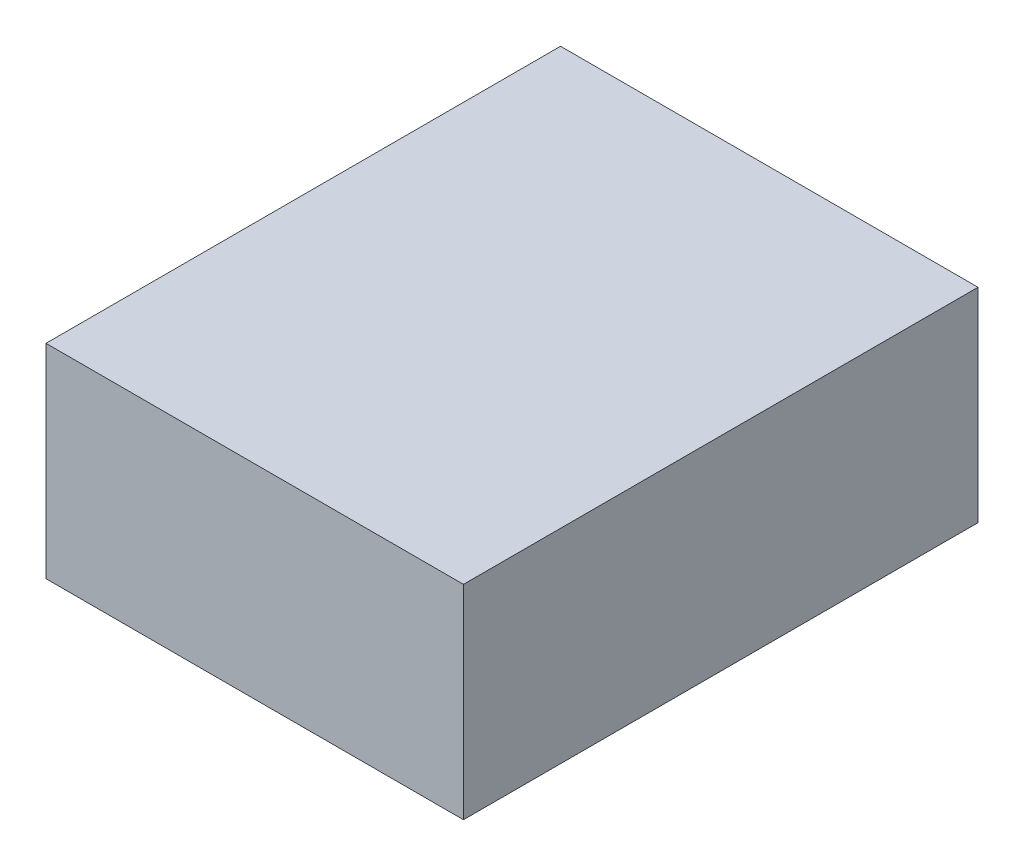
ISO-10303-21;
HEADER;
FILE_DESCRIPTION(('STEP AP214'),'2;1');
FILE_NAME('part.step','',(''),(''),'','','');
FILE_SCHEMA(('AUTOMOTIVE_DESIGN { 1 0 10303 214 1 1 1 1 }'));
ENDSEC;
DATA;
#1=APPLICATION_CONTEXT('core data for automotive mechanical design processes');
#2=APPLICATION_PROTOCOL_DEFINITION('international standard','automotive_design',2000,#1);
#3=PRODUCT_CONTEXT('',#1,'mechanical');
#4=PRODUCT('Part','Part','',(#3));
#5=PRODUCT_RELATED_PRODUCT_CATEGORY('part','',(#4));
#6=PRODUCT_DEFINITION_FORMATION('','',#4);
#7=PRODUCT_DEFINITION_CONTEXT('part definition',#1,'design');
#8=PRODUCT_DEFINITION('design','',#6,#7);
#9=PRODUCT_DEFINITION_SHAPE('','',#8);
#10=(LENGTH_UNIT() NAMED_UNIT(*) SI_UNIT(.MILLI.,.METRE.));
#11=(NAMED_UNIT(*) PLANE_ANGLE_UNIT() SI_UNIT($,.RADIAN.));
#12=(NAMED_UNIT(*) SI_UNIT($,.STERADIAN.) SOLID_ANGLE_UNIT());
#13=UNCERTAINTY_MEASURE_WITH_UNIT(LENGTH_MEASURE(1.E-05),#10,'distance_accuracy_value','');
#14=(GEOMETRIC_REPRESENTATION_CONTEXT(3) GLOBAL_UNCERTAINTY_ASSIGNED_CONTEXT((#13)) GLOBAL_UNIT_ASSIGNED_CONTEXT((#10,
#11,#12)) REPRESENTATION_CONTEXT('',''));
#15=CARTESIAN_POINT('',(0.,0.,0.));
#16=DIRECTION('',(0.,0.,1.));
#17=DIRECTION('',(1.,0.,0.));
#18=AXIS2_PLACEMENT_3D('',#15,#16,#17);
#19=CARTESIAN_POINT('',(0.,21.,0.));
#20=DIRECTION('',(1.,0.,0.));
#21=DIRECTION('',(0.,0.,-1.));
#22=AXIS2_PLACEMENT_3D('',#19,#20,#21);
#23=PLANE('',#22);
#24=DIRECTION('',(0.,0.,1.));
#25=VECTOR('',#24,1.);
#26=CARTESIAN_POINT('',(0.,0.,0.));
#27=LINE('',#26,#25);
#28=CARTESIAN_POINT('',(0.,0.,-53.));
#29=VERTEX_POINT('',#28);
#30=CARTESIAN_POINT('',(0.,0.,0.));
#31=VERTEX_POINT('',#30);
#32=EDGE_CURVE('E107',#29,#31,#27,.T.);
#33=ORIENTED_EDGE('',*,*,#32,.T.);
#34=DIRECTION('',(0.,-1.,0.));
#35=VECTOR('',#34,1.);
#36=CARTESIAN_POINT('',(0.,21.,0.));
#37=LINE('',#36,#35);
#38=CARTESIAN_POINT('',(0.,21.,0.));
#39=VERTEX_POINT('',#38);
#40=EDGE_CURVE('E11',#39,#31,#37,.T.);
#41=ORIENTED_EDGE('',*,*,#40,.F.);
#42=DIRECTION('',(0.,0.,1.));
#43=VECTOR('',#42,1.);
#44=CARTESIAN_POINT('',(0.,21.,0.));
#45=LINE('',#44,#43);
#46=CARTESIAN_POINT('',(0.,21.,-53.));
#47=VERTEX_POINT('',#46);
#48=EDGE_CURVE('E91',#47,#39,#45,.T.);
#49=ORIENTED_EDGE('',*,*,#48,.F.);
#50=DIRECTION('',(0.,-1.,0.));
#51=VECTOR('',#50,1.);
#52=CARTESIAN_POINT('',(0.,21.,-53.));
#53=LINE('',#52,#51);
#54=EDGE_CURVE('E103',#47,#29,#53,.T.);
#55=ORIENTED_EDGE('',*,*,#54,.T.);
#56=EDGE_LOOP('',(#33,#41,#49,#55));
#57=FACE_BOUND('',#56,.T.);
#58=ADVANCED_FACE('F39',(#57),#23,.F.);
#59=CARTESIAN_POINT('',(0.,21.,0.));
#60=DIRECTION('',(0.,0.,-1.));
#61=DIRECTION('',(-1.,0.,0.));
#62=AXIS2_PLACEMENT_3D('',#59,#60,#61);
#63=PLANE('',#62);
#64=DIRECTION('',(1.,0.,0.));
#65=VECTOR('',#64,1.);
#66=CARTESIAN_POINT('',(0.,0.,0.));
#67=LINE('',#66,#65);
#68=CARTESIAN_POINT('',(43.,0.,0.));
#69=VERTEX_POINT('',#68);
#70=EDGE_CURVE('E96',#31,#69,#67,.T.);
#71=ORIENTED_EDGE('',*,*,#70,.T.);
#72=DIRECTION('',(0.,-1.,0.));
#73=VECTOR('',#72,1.);
#74=CARTESIAN_POINT('',(43.,21.,0.));
#75=LINE('',#74,#73);
#76=CARTESIAN_POINT('',(43.,21.,0.));
#77=VERTEX_POINT('',#76);
#78=EDGE_CURVE('E48',#77,#69,#75,.T.);
#79=ORIENTED_EDGE('',*,*,#78,.F.);
#80=DIRECTION('',(1.,0.,0.));
#81=VECTOR('',#80,1.);
#82=CARTESIAN_POINT('',(0.,21.,0.));
#83=LINE('',#82,#81);
#84=EDGE_CURVE('E86',#39,#77,#83,.T.);
#85=ORIENTED_EDGE('',*,*,#84,.F.);
#86=ORIENTED_EDGE('',*,*,#40,.T.);
#87=EDGE_LOOP('',(#71,#79,#85,#86));
#88=FACE_BOUND('',#87,.T.);
#89=ADVANCED_FACE('F95',(#88),#63,.F.);
#90=CARTESIAN_POINT('',(43.,21.,0.));
#91=DIRECTION('',(-1.,0.,0.));
#92=DIRECTION('',(0.,0.,1.));
#93=AXIS2_PLACEMENT_3D('',#90,#91,#92);
#94=PLANE('',#93);
#95=DIRECTION('',(0.,0.,-1.));
#96=VECTOR('',#95,1.);
#97=CARTESIAN_POINT('',(43.,0.,0.));
#98=LINE('',#97,#96);
#99=CARTESIAN_POINT('',(43.,0.,-53.));
#100=VERTEX_POINT('',#99);
#101=EDGE_CURVE('E73',#69,#100,#98,.T.);
#102=ORIENTED_EDGE('',*,*,#101,.T.);
#103=DIRECTION('',(0.,-1.,0.));
#104=VECTOR('',#103,1.);
#105=CARTESIAN_POINT('',(43.,21.,-53.));
#106=LINE('',#105,#104);
#107=CARTESIAN_POINT('',(43.,21.,-53.));
#108=VERTEX_POINT('',#107);
#109=EDGE_CURVE('E98',#108,#100,#106,.T.);
#110=ORIENTED_EDGE('',*,*,#109,.F.);
#111=DIRECTION('',(0.,0.,-1.));
#112=VECTOR('',#111,1.);
#113=CARTESIAN_POINT('',(43.,21.,0.));
#114=LINE('',#113,#112);
#115=EDGE_CURVE('E89',#77,#108,#114,.T.);
#116=ORIENTED_EDGE('',*,*,#115,.F.);
#117=ORIENTED_EDGE('',*,*,#78,.T.);
#118=EDGE_LOOP('',(#102,#110,#116,#117));
#119=FACE_BOUND('',#118,.T.);
#120=ADVANCED_FACE('F99',(#119),#94,.F.);
#121=CARTESIAN_POINT('',(0.,21.,-53.));
#122=DIRECTION('',(0.,0.,1.));
#123=DIRECTION('',(1.,0.,0.));
#124=AXIS2_PLACEMENT_3D('',#121,#122,#123);
#125=PLANE('',#124);
#126=DIRECTION('',(-1.,0.,0.));
#127=VECTOR('',#126,1.);
#128=CARTESIAN_POINT('',(0.,0.,-53.));
#129=LINE('',#128,#127);
#130=EDGE_CURVE('E79',#100,#29,#129,.T.);
#131=ORIENTED_EDGE('',*,*,#130,.T.);
#132=ORIENTED_EDGE('',*,*,#54,.F.);
#133=DIRECTION('',(-1.,0.,0.));
#134=VECTOR('',#133,1.);
#135=CARTESIAN_POINT('',(0.,21.,-53.));
#136=LINE('',#135,#134);
#137=EDGE_CURVE('E56',#108,#47,#136,.T.);
#138=ORIENTED_EDGE('',*,*,#137,.F.);
#139=ORIENTED_EDGE('',*,*,#109,.T.);
#140=EDGE_LOOP('',(#131,#132,#138,#139));
#141=FACE_BOUND('',#140,.T.);
#142=ADVANCED_FACE('F120',(#141),#125,.F.);
#143=CARTESIAN_POINT('',(0.,21.,0.));
#144=DIRECTION('',(0.,-1.,0.));
#145=DIRECTION('',(0.,0.,-1.));
#146=AXIS2_PLACEMENT_3D('',#143,#144,#145);
#147=PLANE('',#146);
#148=ORIENTED_EDGE('',*,*,#48,.T.);
#149=ORIENTED_EDGE('',*,*,#84,.T.);
#150=ORIENTED_EDGE('',*,*,#115,.T.);
#151=ORIENTED_EDGE('',*,*,#137,.T.);
#152=EDGE_LOOP('',(#148,#149,#150,#151));
#153=FACE_BOUND('',#152,.T.);
#154=ADVANCED_FACE('F87',(#153),#147,.F.);
#155=CARTESIAN_POINT('',(0.,0.,0.));
#156=DIRECTION('',(0.,-1.,0.));
#157=DIRECTION('',(0.,0.,-1.));
#158=AXIS2_PLACEMENT_3D('',#155,#156,#157);
#159=PLANE('',#158);
#160=ORIENTED_EDGE('',*,*,#32,.F.);
#161=ORIENTED_EDGE('',*,*,#130,.F.);
#162=ORIENTED_EDGE('',*,*,#101,.F.);
#163=ORIENTED_EDGE('',*,*,#70,.F.);
#164=EDGE_LOOP('',(#160,#161,#162,#163));
#165=FACE_BOUND('',#164,.T.);
#166=ADVANCED_FACE('F123',(#165),#159,.T.);
#167=CLOSED_SHELL('',(#58,#89,#120,#142,#154,#166));
#168=MANIFOLD_SOLID_BREP('B2',#167);
#169=ADVANCED_BREP_SHAPE_REPRESENTATION('',(#18,#168),#14);
#170=SHAPE_DEFINITION_REPRESENTATION(#9,#169);
ENDSEC;
END-ISO-10303-21;
